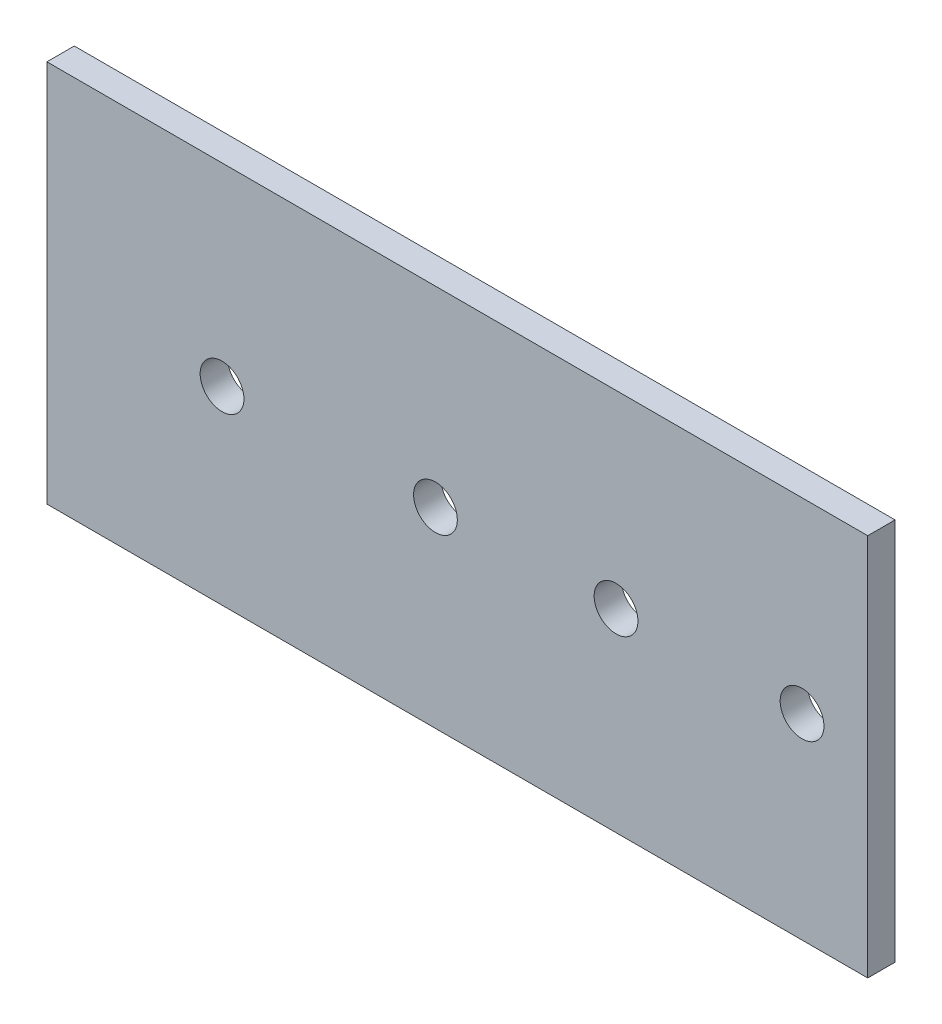
ISO-10303-21;
HEADER;
FILE_DESCRIPTION(('STEP AP214'),'2;1');
FILE_NAME('part.step','',(''),(''),'','','');
FILE_SCHEMA(('AUTOMOTIVE_DESIGN { 1 0 10303 214 1 1 1 1 }'));
ENDSEC;
DATA;
#1=APPLICATION_CONTEXT('core data for automotive mechanical design processes');
#2=APPLICATION_PROTOCOL_DEFINITION('international standard','automotive_design',2000,#1);
#3=PRODUCT_CONTEXT('',#1,'mechanical');
#4=PRODUCT('Part','Part','',(#3));
#5=PRODUCT_RELATED_PRODUCT_CATEGORY('part','',(#4));
#6=PRODUCT_DEFINITION_FORMATION('','',#4);
#7=PRODUCT_DEFINITION_CONTEXT('part definition',#1,'design');
#8=PRODUCT_DEFINITION('design','',#6,#7);
#9=PRODUCT_DEFINITION_SHAPE('','',#8);
#10=(LENGTH_UNIT() NAMED_UNIT(*) SI_UNIT(.MILLI.,.METRE.));
#11=(NAMED_UNIT(*) PLANE_ANGLE_UNIT() SI_UNIT($,.RADIAN.));
#12=(NAMED_UNIT(*) SI_UNIT($,.STERADIAN.) SOLID_ANGLE_UNIT());
#13=UNCERTAINTY_MEASURE_WITH_UNIT(LENGTH_MEASURE(1.E-05),#10,'distance_accuracy_value','');
#14=(GEOMETRIC_REPRESENTATION_CONTEXT(3) GLOBAL_UNCERTAINTY_ASSIGNED_CONTEXT((#13)) GLOBAL_UNIT_ASSIGNED_CONTEXT((#10,
#11,#12)) REPRESENTATION_CONTEXT('',''));
#15=CARTESIAN_POINT('',(0.,0.,0.));
#16=DIRECTION('',(0.,0.,1.));
#17=DIRECTION('',(1.,0.,0.));
#18=AXIS2_PLACEMENT_3D('',#15,#16,#17);
#19=CARTESIAN_POINT('',(75.,-35.,2.5));
#20=DIRECTION('',(-1.,0.,0.));
#21=DIRECTION('',(0.,0.,1.));
#22=AXIS2_PLACEMENT_3D('',#19,#20,#21);
#23=PLANE('',#22);
#24=DIRECTION('',(0.,1.,0.));
#25=VECTOR('',#24,1.);
#26=CARTESIAN_POINT('',(75.,-35.,-2.5));
#27=LINE('',#26,#25);
#28=CARTESIAN_POINT('',(75.,-35.,-2.5));
#29=VERTEX_POINT('',#28);
#30=CARTESIAN_POINT('',(75.,35.,-2.5));
#31=VERTEX_POINT('',#30);
#32=EDGE_CURVE('E106',#29,#31,#27,.T.);
#33=ORIENTED_EDGE('',*,*,#32,.T.);
#34=DIRECTION('',(0.,0.,-1.));
#35=VECTOR('',#34,1.);
#36=CARTESIAN_POINT('',(75.,35.,2.5));
#37=LINE('',#36,#35);
#38=CARTESIAN_POINT('',(75.,35.,2.5));
#39=VERTEX_POINT('',#38);
#40=EDGE_CURVE('E11',#39,#31,#37,.T.);
#41=ORIENTED_EDGE('',*,*,#40,.F.);
#42=DIRECTION('',(0.,1.,0.));
#43=VECTOR('',#42,1.);
#44=CARTESIAN_POINT('',(75.,-35.,2.5));
#45=LINE('',#44,#43);
#46=CARTESIAN_POINT('',(75.,-35.,2.5));
#47=VERTEX_POINT('',#46);
#48=EDGE_CURVE('E94',#47,#39,#45,.T.);
#49=ORIENTED_EDGE('',*,*,#48,.F.);
#50=DIRECTION('',(0.,0.,-1.));
#51=VECTOR('',#50,1.);
#52=CARTESIAN_POINT('',(75.,-35.,2.5));
#53=LINE('',#52,#51);
#54=EDGE_CURVE('E102',#47,#29,#53,.T.);
#55=ORIENTED_EDGE('',*,*,#54,.T.);
#56=EDGE_LOOP('',(#33,#41,#49,#55));
#57=FACE_BOUND('',#56,.T.);
#58=ADVANCED_FACE('F43',(#57),#23,.F.);
#59=CARTESIAN_POINT('',(-75.,35.,2.5));
#60=DIRECTION('',(0.,-1.,0.));
#61=DIRECTION('',(0.,0.,-1.));
#62=AXIS2_PLACEMENT_3D('',#59,#60,#61);
#63=PLANE('',#62);
#64=DIRECTION('',(-1.,0.,0.));
#65=VECTOR('',#64,1.);
#66=CARTESIAN_POINT('',(-75.,35.,-2.5));
#67=LINE('',#66,#65);
#68=CARTESIAN_POINT('',(-75.,35.,-2.5));
#69=VERTEX_POINT('',#68);
#70=EDGE_CURVE('E98',#31,#69,#67,.T.);
#71=ORIENTED_EDGE('',*,*,#70,.T.);
#72=DIRECTION('',(0.,0.,-1.));
#73=VECTOR('',#72,1.);
#74=CARTESIAN_POINT('',(-75.,35.,2.5));
#75=LINE('',#74,#73);
#76=CARTESIAN_POINT('',(-75.,35.,2.5));
#77=VERTEX_POINT('',#76);
#78=EDGE_CURVE('E51',#77,#69,#75,.T.);
#79=ORIENTED_EDGE('',*,*,#78,.F.);
#80=DIRECTION('',(-1.,0.,0.));
#81=VECTOR('',#80,1.);
#82=CARTESIAN_POINT('',(-75.,35.,2.5));
#83=LINE('',#82,#81);
#84=EDGE_CURVE('E89',#39,#77,#83,.T.);
#85=ORIENTED_EDGE('',*,*,#84,.F.);
#86=ORIENTED_EDGE('',*,*,#40,.T.);
#87=EDGE_LOOP('',(#71,#79,#85,#86));
#88=FACE_BOUND('',#87,.T.);
#89=ADVANCED_FACE('F97',(#88),#63,.F.);
#90=CARTESIAN_POINT('',(-75.,-35.,2.5));
#91=DIRECTION('',(1.,0.,0.));
#92=DIRECTION('',(0.,0.,-1.));
#93=AXIS2_PLACEMENT_3D('',#90,#91,#92);
#94=PLANE('',#93);
#95=DIRECTION('',(0.,-1.,0.));
#96=VECTOR('',#95,1.);
#97=CARTESIAN_POINT('',(-75.,-35.,-2.5));
#98=LINE('',#97,#96);
#99=CARTESIAN_POINT('',(-75.,-35.,-2.5));
#100=VERTEX_POINT('',#99);
#101=EDGE_CURVE('E76',#69,#100,#98,.T.);
#102=ORIENTED_EDGE('',*,*,#101,.T.);
#103=DIRECTION('',(0.,0.,-1.));
#104=VECTOR('',#103,1.);
#105=CARTESIAN_POINT('',(-75.,-35.,2.5));
#106=LINE('',#105,#104);
#107=CARTESIAN_POINT('',(-75.,-35.,2.5));
#108=VERTEX_POINT('',#107);
#109=EDGE_CURVE('E99',#108,#100,#106,.T.);
#110=ORIENTED_EDGE('',*,*,#109,.F.);
#111=DIRECTION('',(0.,-1.,0.));
#112=VECTOR('',#111,1.);
#113=CARTESIAN_POINT('',(-75.,-35.,2.5));
#114=LINE('',#113,#112);
#115=EDGE_CURVE('E92',#77,#108,#114,.T.);
#116=ORIENTED_EDGE('',*,*,#115,.F.);
#117=ORIENTED_EDGE('',*,*,#78,.T.);
#118=EDGE_LOOP('',(#102,#110,#116,#117));
#119=FACE_BOUND('',#118,.T.);
#120=ADVANCED_FACE('F100',(#119),#94,.F.);
#121=CARTESIAN_POINT('',(-75.,-35.,2.5));
#122=DIRECTION('',(0.,1.,0.));
#123=DIRECTION('',(0.,0.,1.));
#124=AXIS2_PLACEMENT_3D('',#121,#122,#123);
#125=PLANE('',#124);
#126=DIRECTION('',(1.,0.,0.));
#127=VECTOR('',#126,1.);
#128=CARTESIAN_POINT('',(-75.,-35.,-2.5));
#129=LINE('',#128,#127);
#130=EDGE_CURVE('E82',#100,#29,#129,.T.);
#131=ORIENTED_EDGE('',*,*,#130,.T.);
#132=ORIENTED_EDGE('',*,*,#54,.F.);
#133=DIRECTION('',(1.,0.,0.));
#134=VECTOR('',#133,1.);
#135=CARTESIAN_POINT('',(-75.,-35.,2.5));
#136=LINE('',#135,#134);
#137=EDGE_CURVE('E59',#108,#47,#136,.T.);
#138=ORIENTED_EDGE('',*,*,#137,.F.);
#139=ORIENTED_EDGE('',*,*,#109,.T.);
#140=EDGE_LOOP('',(#131,#132,#138,#139));
#141=FACE_BOUND('',#140,.T.);
#142=ADVANCED_FACE('F114',(#141),#125,.F.);
#143=CARTESIAN_POINT('',(0.,0.,2.5));
#144=DIRECTION('',(0.,0.,-1.));
#145=DIRECTION('',(-1.,0.,0.));
#146=AXIS2_PLACEMENT_3D('',#143,#144,#145);
#147=PLANE('',#146);
#148=CARTESIAN_POINT('',(63.0000000000001,0.851199239555261,2.5));
#149=DIRECTION('',(0.,0.,1.));
#150=DIRECTION('',(1.,0.,0.));
#151=AXIS2_PLACEMENT_3D('',#148,#149,#150);
#152=CIRCLE('',#151,4.00000000000001);
#153=CARTESIAN_POINT('',(67.0000000000001,0.851199239555261,2.5));
#154=VERTEX_POINT('',#153);
#155=EDGE_CURVE('E133',#154,#154,#152,.T.);
#156=ORIENTED_EDGE('',*,*,#155,.F.);
#157=EDGE_LOOP('',(#156));
#158=FACE_BOUND('',#157,.T.);
#159=CARTESIAN_POINT('',(-3.99705161979855,0.,2.5));
#160=DIRECTION('',(0.,0.,1.));
#161=DIRECTION('',(1.,0.,0.));
#162=AXIS2_PLACEMENT_3D('',#159,#160,#161);
#163=CIRCLE('',#162,4.);
#164=CARTESIAN_POINT('',(0.0029483802014528,0.,2.5));
#165=VERTEX_POINT('',#164);
#166=EDGE_CURVE('E124',#165,#165,#163,.T.);
#167=ORIENTED_EDGE('',*,*,#166,.F.);
#168=EDGE_LOOP('',(#167));
#169=FACE_BOUND('',#168,.T.);
#170=CARTESIAN_POINT('',(-42.9953353984874,-0.36587199518948,2.5));
#171=DIRECTION('',(0.,0.,1.));
#172=DIRECTION('',(1.,0.,0.));
#173=AXIS2_PLACEMENT_3D('',#170,#171,#172);
#174=CIRCLE('',#173,4.00000000000001);
#175=CARTESIAN_POINT('',(-38.9953353984874,-0.36587199518948,2.5));
#176=VERTEX_POINT('',#175);
#177=EDGE_CURVE('E123',#176,#176,#174,.T.);
#178=ORIENTED_EDGE('',*,*,#177,.F.);
#179=EDGE_LOOP('',(#178));
#180=FACE_BOUND('',#179,.T.);
#181=CARTESIAN_POINT('',(29.0022411166862,0.460826453553767,2.5));
#182=DIRECTION('',(0.,0.,1.));
#183=DIRECTION('',(1.,0.,0.));
#184=AXIS2_PLACEMENT_3D('',#181,#182,#183);
#185=CIRCLE('',#184,4.00000000000001);
#186=CARTESIAN_POINT('',(33.0022411166862,0.460826453553767,2.5));
#187=VERTEX_POINT('',#186);
#188=EDGE_CURVE('E130',#187,#187,#185,.T.);
#189=ORIENTED_EDGE('',*,*,#188,.F.);
#190=EDGE_LOOP('',(#189));
#191=FACE_BOUND('',#190,.T.);
#192=ORIENTED_EDGE('',*,*,#48,.T.);
#193=ORIENTED_EDGE('',*,*,#84,.T.);
#194=ORIENTED_EDGE('',*,*,#115,.T.);
#195=ORIENTED_EDGE('',*,*,#137,.T.);
#196=EDGE_LOOP('',(#192,#193,#194,#195));
#197=FACE_BOUND('',#196,.T.);
#198=ADVANCED_FACE('F90',(#158,#169,#180,#191,#197),#147,.F.);
#199=CARTESIAN_POINT('',(0.,0.,-2.5));
#200=DIRECTION('',(0.,0.,-1.));
#201=DIRECTION('',(-1.,0.,0.));
#202=AXIS2_PLACEMENT_3D('',#199,#200,#201);
#203=PLANE('',#202);
#204=CARTESIAN_POINT('',(63.0000000000001,0.851199239555261,-2.5));
#205=DIRECTION('',(0.,0.,1.));
#206=DIRECTION('',(1.,0.,0.));
#207=AXIS2_PLACEMENT_3D('',#204,#205,#206);
#208=CIRCLE('',#207,4.00000000000001);
#209=CARTESIAN_POINT('',(67.0000000000001,0.851199239555261,-2.5));
#210=VERTEX_POINT('',#209);
#211=EDGE_CURVE('E109',#210,#210,#208,.T.);
#212=ORIENTED_EDGE('',*,*,#211,.T.);
#213=EDGE_LOOP('',(#212));
#214=FACE_BOUND('',#213,.T.);
#215=CARTESIAN_POINT('',(-3.99705161979855,0.,-2.5));
#216=DIRECTION('',(0.,0.,1.));
#217=DIRECTION('',(1.,0.,0.));
#218=AXIS2_PLACEMENT_3D('',#215,#216,#217);
#219=CIRCLE('',#218,4.);
#220=CARTESIAN_POINT('',(0.0029483802014528,0.,-2.5));
#221=VERTEX_POINT('',#220);
#222=EDGE_CURVE('E134',#221,#221,#219,.T.);
#223=ORIENTED_EDGE('',*,*,#222,.T.);
#224=EDGE_LOOP('',(#223));
#225=FACE_BOUND('',#224,.T.);
#226=CARTESIAN_POINT('',(-42.9953353984874,-0.36587199518948,-2.5));
#227=DIRECTION('',(0.,0.,1.));
#228=DIRECTION('',(1.,0.,0.));
#229=AXIS2_PLACEMENT_3D('',#226,#227,#228);
#230=CIRCLE('',#229,4.00000000000001);
#231=CARTESIAN_POINT('',(-38.9953353984874,-0.36587199518948,-2.5));
#232=VERTEX_POINT('',#231);
#233=EDGE_CURVE('E120',#232,#232,#230,.T.);
#234=ORIENTED_EDGE('',*,*,#233,.T.);
#235=EDGE_LOOP('',(#234));
#236=FACE_BOUND('',#235,.T.);
#237=CARTESIAN_POINT('',(29.0022411166862,0.460826453553767,-2.5));
#238=DIRECTION('',(0.,0.,1.));
#239=DIRECTION('',(1.,0.,0.));
#240=AXIS2_PLACEMENT_3D('',#237,#238,#239);
#241=CIRCLE('',#240,4.00000000000001);
#242=CARTESIAN_POINT('',(33.0022411166862,0.460826453553767,-2.5));
#243=VERTEX_POINT('',#242);
#244=EDGE_CURVE('E127',#243,#243,#241,.T.);
#245=ORIENTED_EDGE('',*,*,#244,.T.);
#246=EDGE_LOOP('',(#245));
#247=FACE_BOUND('',#246,.T.);
#248=ORIENTED_EDGE('',*,*,#32,.F.);
#249=ORIENTED_EDGE('',*,*,#130,.F.);
#250=ORIENTED_EDGE('',*,*,#101,.F.);
#251=ORIENTED_EDGE('',*,*,#70,.F.);
#252=EDGE_LOOP('',(#248,#249,#250,#251));
#253=FACE_BOUND('',#252,.T.);
#254=ADVANCED_FACE('F117',(#214,#225,#236,#247,#253),#203,.T.);
#255=CARTESIAN_POINT('',(29.0022411166862,0.460826453553767,-2.5));
#256=DIRECTION('',(0.,0.,1.));
#257=DIRECTION('',(1.,0.,0.));
#258=AXIS2_PLACEMENT_3D('',#255,#256,#257);
#259=CYLINDRICAL_SURFACE('',#258,4.00000000000001);
#260=ORIENTED_EDGE('',*,*,#244,.F.);
#261=EDGE_LOOP('',(#260));
#262=FACE_BOUND('',#261,.T.);
#263=ORIENTED_EDGE('',*,*,#188,.T.);
#264=EDGE_LOOP('',(#263));
#265=FACE_BOUND('',#264,.T.);
#266=ADVANCED_FACE('F162',(#262,#265),#259,.F.);
#267=CARTESIAN_POINT('',(-42.9953353984874,-0.36587199518948,-2.5));
#268=DIRECTION('',(0.,0.,1.));
#269=DIRECTION('',(1.,0.,0.));
#270=AXIS2_PLACEMENT_3D('',#267,#268,#269);
#271=CYLINDRICAL_SURFACE('',#270,4.00000000000001);
#272=ORIENTED_EDGE('',*,*,#233,.F.);
#273=EDGE_LOOP('',(#272));
#274=FACE_BOUND('',#273,.T.);
#275=ORIENTED_EDGE('',*,*,#177,.T.);
#276=EDGE_LOOP('',(#275));
#277=FACE_BOUND('',#276,.T.);
#278=ADVANCED_FACE('F164',(#274,#277),#271,.F.);
#279=CARTESIAN_POINT('',(-3.99705161979855,0.,-2.5));
#280=DIRECTION('',(0.,0.,1.));
#281=DIRECTION('',(1.,0.,0.));
#282=AXIS2_PLACEMENT_3D('',#279,#280,#281);
#283=CYLINDRICAL_SURFACE('',#282,4.);
#284=ORIENTED_EDGE('',*,*,#222,.F.);
#285=EDGE_LOOP('',(#284));
#286=FACE_BOUND('',#285,.T.);
#287=ORIENTED_EDGE('',*,*,#166,.T.);
#288=EDGE_LOOP('',(#287));
#289=FACE_BOUND('',#288,.T.);
#290=ADVANCED_FACE('F149',(#286,#289),#283,.F.);
#291=CARTESIAN_POINT('',(63.0000000000001,0.851199239555261,-2.5));
#292=DIRECTION('',(0.,0.,1.));
#293=DIRECTION('',(1.,0.,0.));
#294=AXIS2_PLACEMENT_3D('',#291,#292,#293);
#295=CYLINDRICAL_SURFACE('',#294,4.00000000000001);
#296=ORIENTED_EDGE('',*,*,#211,.F.);
#297=EDGE_LOOP('',(#296));
#298=FACE_BOUND('',#297,.T.);
#299=ORIENTED_EDGE('',*,*,#155,.T.);
#300=EDGE_LOOP('',(#299));
#301=FACE_BOUND('',#300,.T.);
#302=ADVANCED_FACE('F146',(#298,#301),#295,.F.);
#303=CLOSED_SHELL('',(#58,#89,#120,#142,#198,#254,#266,#278,#290,#302));
#304=MANIFOLD_SOLID_BREP('B2',#303);
#305=ADVANCED_BREP_SHAPE_REPRESENTATION('',(#18,#304),#14);
#306=SHAPE_DEFINITION_REPRESENTATION(#9,#305);
ENDSEC;
END-ISO-10303-21;
